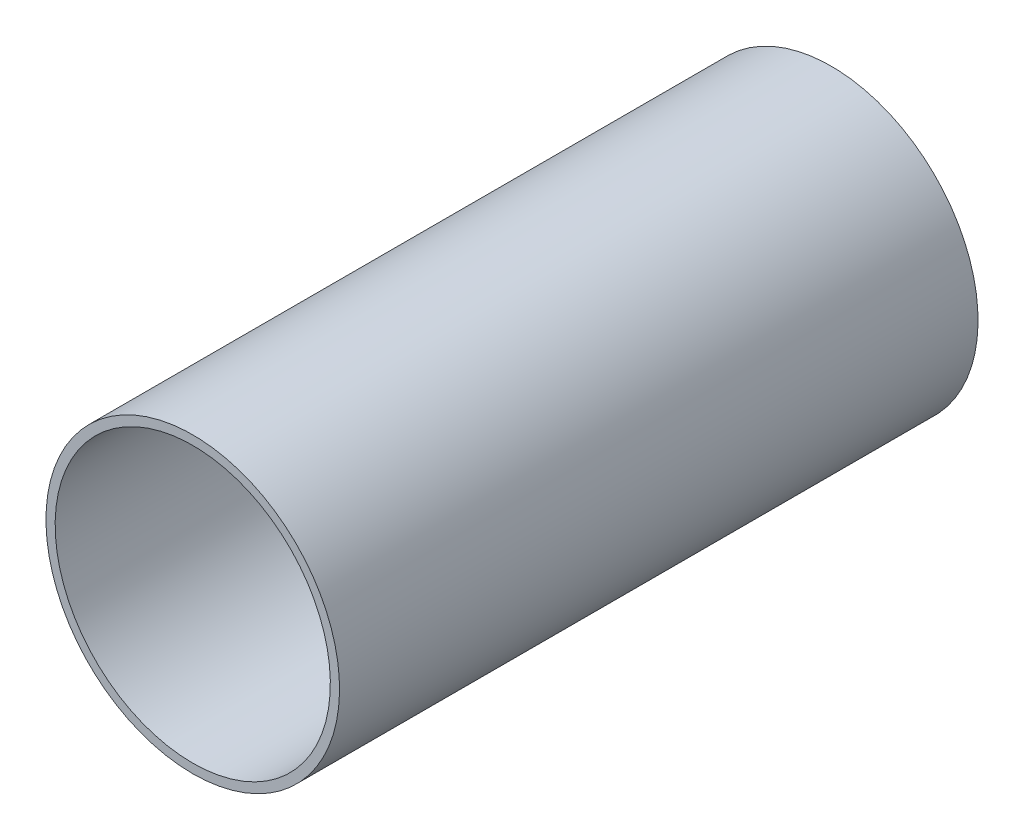
ISO-10303-21;
HEADER;
FILE_DESCRIPTION(('STEP AP214'),'2;1');
FILE_NAME('part.step','',(''),(''),'','','');
FILE_SCHEMA(('AUTOMOTIVE_DESIGN { 1 0 10303 214 1 1 1 1 }'));
ENDSEC;
DATA;
#1=APPLICATION_CONTEXT('core data for automotive mechanical design processes');
#2=APPLICATION_PROTOCOL_DEFINITION('international standard','automotive_design',2000,#1);
#3=PRODUCT_CONTEXT('',#1,'mechanical');
#4=PRODUCT('Part','Part','',(#3));
#5=PRODUCT_RELATED_PRODUCT_CATEGORY('part','',(#4));
#6=PRODUCT_DEFINITION_FORMATION('','',#4);
#7=PRODUCT_DEFINITION_CONTEXT('part definition',#1,'design');
#8=PRODUCT_DEFINITION('design','',#6,#7);
#9=PRODUCT_DEFINITION_SHAPE('','',#8);
#10=(LENGTH_UNIT() NAMED_UNIT(*) SI_UNIT(.MILLI.,.METRE.));
#11=(NAMED_UNIT(*) PLANE_ANGLE_UNIT() SI_UNIT($,.RADIAN.));
#12=(NAMED_UNIT(*) SI_UNIT($,.STERADIAN.) SOLID_ANGLE_UNIT());
#13=UNCERTAINTY_MEASURE_WITH_UNIT(LENGTH_MEASURE(1.E-05),#10,'distance_accuracy_value','');
#14=(GEOMETRIC_REPRESENTATION_CONTEXT(3) GLOBAL_UNCERTAINTY_ASSIGNED_CONTEXT((#13)) GLOBAL_UNIT_ASSIGNED_CONTEXT((#10,
#11,#12)) REPRESENTATION_CONTEXT('',''));
#15=CARTESIAN_POINT('',(0.,0.,0.));
#16=DIRECTION('',(0.,0.,1.));
#17=DIRECTION('',(1.,0.,0.));
#18=AXIS2_PLACEMENT_3D('',#15,#16,#17);
#19=CARTESIAN_POINT('',(167.64,-103.632,-0.045));
#20=DIRECTION('',(0.,0.,-1.));
#21=DIRECTION('',(0.,-1.,0.));
#22=AXIS2_PLACEMENT_3D('',#19,#20,#21);
#23=CYLINDRICAL_SURFACE('',#22,0.375);
#24=CARTESIAN_POINT('',(167.64,-103.632,-0.035));
#25=DIRECTION('',(0.,0.,-1.));
#26=DIRECTION('',(0.,-1.,0.));
#27=AXIS2_PLACEMENT_3D('',#24,#25,#26);
#28=CIRCLE('',#27,0.375);
#29=CARTESIAN_POINT('',(167.64,-104.007,-0.035));
#30=VERTEX_POINT('',#29);
#31=EDGE_CURVE('E65',#30,#30,#28,.T.);
#32=ORIENTED_EDGE('',*,*,#31,.T.);
#33=DIRECTION('',(0.,0.,1.));
#34=VECTOR('',#33,1.);
#35=CARTESIAN_POINT('',(167.64,-104.007,-0.045));
#36=LINE('',#35,#34);
#37=CARTESIAN_POINT('',(167.64,-104.007,1.705));
#38=VERTEX_POINT('',#37);
#39=EDGE_CURVE('E11',#30,#38,#36,.T.);
#40=ORIENTED_EDGE('',*,*,#39,.T.);
#41=CARTESIAN_POINT('',(167.64,-103.632,1.705));
#42=DIRECTION('',(0.,0.,-1.));
#43=DIRECTION('',(0.,-1.,0.));
#44=AXIS2_PLACEMENT_3D('',#41,#42,#43);
#45=CIRCLE('',#44,0.375);
#46=EDGE_CURVE('E26',#38,#38,#45,.T.);
#47=ORIENTED_EDGE('',*,*,#46,.F.);
#48=ORIENTED_EDGE('',*,*,#39,.F.);
#49=EDGE_LOOP('',(#32,#40,#47,#48));
#50=FACE_BOUND('',#49,.T.);
#51=ADVANCED_FACE('F17',(#50),#23,.F.);
#52=CARTESIAN_POINT('',(167.64,-104.032,1.705));
#53=DIRECTION('',(0.,0.,1.));
#54=DIRECTION('',(1.,0.,0.));
#55=AXIS2_PLACEMENT_3D('',#52,#53,#54);
#56=PLANE('',#55);
#57=ORIENTED_EDGE('',*,*,#46,.T.);
#58=EDGE_LOOP('',(#57));
#59=FACE_BOUND('',#58,.T.);
#60=CARTESIAN_POINT('',(167.64,-103.632,1.705));
#61=DIRECTION('',(0.,0.,1.));
#62=DIRECTION('',(0.,-1.,0.));
#63=AXIS2_PLACEMENT_3D('',#60,#61,#62);
#64=CIRCLE('',#63,0.4);
#65=CARTESIAN_POINT('',(167.64,-104.032,1.705));
#66=VERTEX_POINT('',#65);
#67=EDGE_CURVE('E57',#66,#66,#64,.T.);
#68=ORIENTED_EDGE('',*,*,#67,.T.);
#69=EDGE_LOOP('',(#68));
#70=FACE_BOUND('',#69,.T.);
#71=ADVANCED_FACE('F19',(#59,#70),#56,.T.);
#72=CARTESIAN_POINT('',(167.64,-104.032,-0.035));
#73=DIRECTION('',(0.,0.,1.));
#74=DIRECTION('',(1.,0.,0.));
#75=AXIS2_PLACEMENT_3D('',#72,#73,#74);
#76=PLANE('',#75);
#77=ORIENTED_EDGE('',*,*,#31,.F.);
#78=EDGE_LOOP('',(#77));
#79=FACE_BOUND('',#78,.T.);
#80=CARTESIAN_POINT('',(167.64,-103.632,-0.035));
#81=DIRECTION('',(0.,0.,1.));
#82=DIRECTION('',(0.,-1.,0.));
#83=AXIS2_PLACEMENT_3D('',#80,#81,#82);
#84=CIRCLE('',#83,0.4);
#85=CARTESIAN_POINT('',(167.64,-104.032,-0.035));
#86=VERTEX_POINT('',#85);
#87=EDGE_CURVE('E56',#86,#86,#84,.T.);
#88=ORIENTED_EDGE('',*,*,#87,.F.);
#89=EDGE_LOOP('',(#88));
#90=FACE_BOUND('',#89,.T.);
#91=ADVANCED_FACE('F78',(#79,#90),#76,.F.);
#92=CARTESIAN_POINT('',(167.64,-103.632,-0.035));
#93=DIRECTION('',(0.,0.,-1.));
#94=DIRECTION('',(0.,-1.,0.));
#95=AXIS2_PLACEMENT_3D('',#92,#93,#94);
#96=CYLINDRICAL_SURFACE('',#95,0.4);
#97=ORIENTED_EDGE('',*,*,#87,.T.);
#98=DIRECTION('',(0.,0.,1.));
#99=VECTOR('',#98,1.);
#100=CARTESIAN_POINT('',(167.64,-104.032,-0.035));
#101=LINE('',#100,#99);
#102=EDGE_CURVE('E53',#86,#66,#101,.T.);
#103=ORIENTED_EDGE('',*,*,#102,.T.);
#104=ORIENTED_EDGE('',*,*,#67,.F.);
#105=ORIENTED_EDGE('',*,*,#102,.F.);
#106=EDGE_LOOP('',(#97,#103,#104,#105));
#107=FACE_BOUND('',#106,.T.);
#108=ADVANCED_FACE('F54',(#107),#96,.T.);
#109=CLOSED_SHELL('',(#51,#71,#91,#108));
#110=MANIFOLD_SOLID_BREP('B1',#109);
#111=ADVANCED_BREP_SHAPE_REPRESENTATION('',(#18,#110),#14);
#112=SHAPE_DEFINITION_REPRESENTATION(#9,#111);
ENDSEC;
END-ISO-10303-21;
